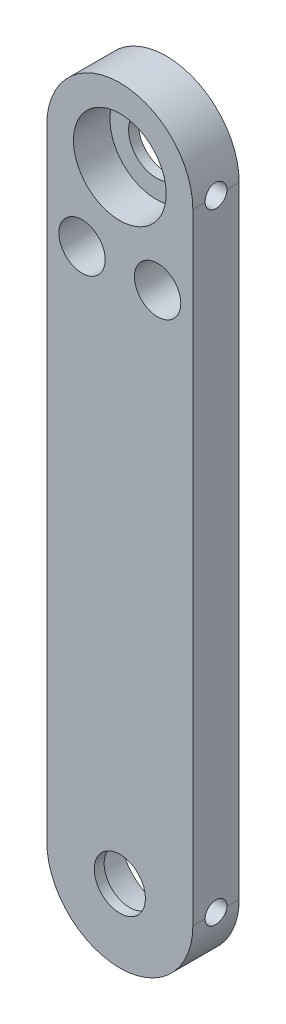
ISO-10303-21;
HEADER;
FILE_DESCRIPTION(('STEP AP214'),'2;1');
FILE_NAME('part.step','',(''),(''),'','','');
FILE_SCHEMA(('AUTOMOTIVE_DESIGN { 1 0 10303 214 1 1 1 1 }'));
ENDSEC;
DATA;
#1=APPLICATION_CONTEXT('core data for automotive mechanical design processes');
#2=APPLICATION_PROTOCOL_DEFINITION('international standard','automotive_design',2000,#1);
#3=PRODUCT_CONTEXT('',#1,'mechanical');
#4=PRODUCT('Part','Part','',(#3));
#5=PRODUCT_RELATED_PRODUCT_CATEGORY('part','',(#4));
#6=PRODUCT_DEFINITION_FORMATION('','',#4);
#7=PRODUCT_DEFINITION_CONTEXT('part definition',#1,'design');
#8=PRODUCT_DEFINITION('design','',#6,#7);
#9=PRODUCT_DEFINITION_SHAPE('','',#8);
#10=(LENGTH_UNIT() NAMED_UNIT(*) SI_UNIT(.MILLI.,.METRE.));
#11=(NAMED_UNIT(*) PLANE_ANGLE_UNIT() SI_UNIT($,.RADIAN.));
#12=(NAMED_UNIT(*) SI_UNIT($,.STERADIAN.) SOLID_ANGLE_UNIT());
#13=UNCERTAINTY_MEASURE_WITH_UNIT(LENGTH_MEASURE(1.E-05),#10,'distance_accuracy_value','');
#14=(GEOMETRIC_REPRESENTATION_CONTEXT(3) GLOBAL_UNCERTAINTY_ASSIGNED_CONTEXT((#13)) GLOBAL_UNIT_ASSIGNED_CONTEXT((#10,
#11,#12)) REPRESENTATION_CONTEXT('',''));
#15=CARTESIAN_POINT('',(0.,0.,0.));
#16=DIRECTION('',(0.,0.,1.));
#17=DIRECTION('',(1.,0.,0.));
#18=AXIS2_PLACEMENT_3D('',#15,#16,#17);
#19=CARTESIAN_POINT('',(0.,42.5,6.35));
#20=DIRECTION('',(0.,0.,-1.));
#21=DIRECTION('',(-1.,0.,0.));
#22=AXIS2_PLACEMENT_3D('',#19,#20,#21);
#23=CYLINDRICAL_SURFACE('',#22,10.);
#24=DIRECTION('',(0.,0.,-1.));
#25=VECTOR('',#24,1.);
#26=CARTESIAN_POINT('',(10.,42.5,6.35));
#27=LINE('',#26,#25);
#28=CARTESIAN_POINT('',(10.,42.5,6.35));
#29=VERTEX_POINT('',#28);
#30=CARTESIAN_POINT('',(10.,42.5,4.675));
#31=VERTEX_POINT('',#30);
#32=EDGE_CURVE('E116',#29,#31,#27,.T.);
#33=ORIENTED_EDGE('',*,*,#32,.T.);
#34=CARTESIAN_POINT('',(10.,42.5,4.675));
#35=CARTESIAN_POINT('',(10.0000014685064,42.5419508736504,4.67499999537497));
#36=CARTESIAN_POINT('',(9.99973568704625,42.5838814247861,4.67323901308362));
#37=CARTESIAN_POINT('',(9.99868521479132,42.6674379610659,4.66621554686748));
#38=CARTESIAN_POINT('',(9.99790056985297,42.709063972796,4.66095337237313));
#39=CARTESIAN_POINT('',(9.99479588619007,42.8329314886251,4.63997389798776));
#40=CARTESIAN_POINT('',(9.99172497314488,42.914336104094,4.61906345213101));
#41=CARTESIAN_POINT('',(9.98391758917327,43.0724284238681,4.56400833880989));
#42=CARTESIAN_POINT('',(9.97918066213689,43.1491148296921,4.52986004691619));
#43=CARTESIAN_POINT('',(9.96856534959666,43.295678956542,4.44931680441856));
#44=CARTESIAN_POINT('',(9.96268699957248,43.3655568890993,4.40292223445846));
#45=CARTESIAN_POINT('',(9.95039202655103,43.4970445259113,4.29882526877398));
#46=CARTESIAN_POINT('',(9.94397197786064,43.5585940245488,4.24104725672947));
#47=CARTESIAN_POINT('',(9.9313432234057,43.6711695622192,4.11597898804128));
#48=CARTESIAN_POINT('',(9.92513455081533,43.7221939557012,4.04868724673824));
#49=CARTESIAN_POINT('',(9.91359860664948,43.8124986952271,3.90609726537435));
#50=CARTESIAN_POINT('',(9.90827581009233,43.8517201783024,3.83076135392111));
#51=CARTESIAN_POINT('',(9.89916189093434,43.9169278188574,3.67448245934921));
#52=CARTESIAN_POINT('',(9.89537059586199,43.9429154667638,3.59354010880837));
#53=CARTESIAN_POINT('',(9.88978259593446,43.980731765885,3.42898294683241));
#54=CARTESIAN_POINT('',(9.88797120063499,43.9926647518175,3.34539262016964));
#55=CARTESIAN_POINT('',(9.88650348181945,44.002356291557,3.17737586593599));
#56=CARTESIAN_POINT('',(9.88684708626085,44.0001153192052,3.09294946640957));
#57=CARTESIAN_POINT('',(9.88963718763456,43.9816073070065,2.92639867029685));
#58=CARTESIAN_POINT('',(9.89206620232456,43.9654568683382,2.84426098127215));
#59=CARTESIAN_POINT('',(9.89872610639239,43.9197709914713,2.68387516321022));
#60=CARTESIAN_POINT('',(9.90295703599484,43.8902352544683,2.60562712104614));
#61=CARTESIAN_POINT('',(9.9127634526375,43.8184953494658,2.45488514064788));
#62=CARTESIAN_POINT('',(9.91834418902924,43.7762415606178,2.38241517319383));
#63=CARTESIAN_POINT('',(9.93021732397089,43.6803019201499,2.2455528505844));
#64=CARTESIAN_POINT('',(9.93650974119488,43.6266157685189,2.18116070747983));
#65=CARTESIAN_POINT('',(9.94917383032146,43.5087036654829,2.06161087632561));
#66=CARTESIAN_POINT('',(9.95554567106682,43.4443788291936,2.00655070165109));
#67=CARTESIAN_POINT('',(9.96759485035053,43.3073265565302,1.90797639950773));
#68=CARTESIAN_POINT('',(9.97327198853175,43.2345967077954,1.86446559874978));
#69=CARTESIAN_POINT('',(9.98329879009977,43.0827046110578,1.79022045732164));
#70=CARTESIAN_POINT('',(9.98764689268088,43.0035349372274,1.75950112360303));
#71=CARTESIAN_POINT('',(9.99450841265943,42.8411362683109,1.7118654141282));
#72=CARTESIAN_POINT('',(9.99702457329285,42.757913542677,1.69492839559142));
#73=CARTESIAN_POINT('',(9.9989901194856,42.6450605368035,1.68174566903024));
#74=CARTESIAN_POINT('',(9.99936853868558,42.6160817227372,1.679214915476));
#75=CARTESIAN_POINT('',(9.99987320258129,42.5580727726573,1.67584431341621));
#76=CARTESIAN_POINT('',(9.99999987181746,42.529042805815,1.67500161822181));
#77=CARTESIAN_POINT('',(10.,42.5,1.675));
#78=B_SPLINE_CURVE_WITH_KNOTS('',3,(#34,#35,#36,#37,#38,#39,#40,#41,#42,#43,#44,#45,#46,#47,#48,
#49,#50,#51,#52,#53,#54,#55,#56,#57,#58,#59,#60,#61,#62,#63,#64,#65,#66,#67,#68,#69,#70,#71,#72,
#73,#74,#75,#76,#77),.UNSPECIFIED.,.F.,.F.,(4,2,2,2,2,2,2,2,2,2,2,2,2,2,2,2,2,2,2,2,2,4),(0.,
0.12577459600247,0.251538077699336,0.502550836025008,0.75363236847621,1.00470609762705,
1.25750755614574,1.5103485090807,1.7644302832657,2.01848343580799,2.27063849496755,
2.52278512452482,2.7728383913245,3.02289724042137,3.27394465404092,3.52499865652247,
3.77853286607112,4.03214002520141,4.28604388366317,4.53956674814969,4.62680426579007,
4.71389454454004),.UNSPECIFIED.);
#79=CARTESIAN_POINT('',(10.,42.5,1.675));
#80=VERTEX_POINT('',#79);
#81=EDGE_CURVE('E65',#31,#80,#78,.T.);
#82=ORIENTED_EDGE('',*,*,#81,.T.);
#83=CARTESIAN_POINT('',(10.,42.5,0.));
#84=VERTEX_POINT('',#83);
#85=EDGE_CURVE('E198',#80,#84,#27,.T.);
#86=ORIENTED_EDGE('',*,*,#85,.T.);
#87=CARTESIAN_POINT('',(0.,42.5,0.));
#88=DIRECTION('',(0.,0.,1.));
#89=DIRECTION('',(1.,0.,0.));
#90=AXIS2_PLACEMENT_3D('',#87,#88,#89);
#91=CIRCLE('',#90,10.);
#92=CARTESIAN_POINT('',(-9.99999999999999,42.5,0.));
#93=VERTEX_POINT('',#92);
#94=EDGE_CURVE('E186',#84,#93,#91,.T.);
#95=ORIENTED_EDGE('',*,*,#94,.T.);
#96=DIRECTION('',(0.,0.,-1.));
#97=VECTOR('',#96,1.);
#98=CARTESIAN_POINT('',(-9.99999999999999,42.5,6.35));
#99=LINE('',#98,#97);
#100=CARTESIAN_POINT('',(-9.99999999999999,42.5,6.35));
#101=VERTEX_POINT('',#100);
#102=EDGE_CURVE('E11',#101,#93,#99,.T.);
#103=ORIENTED_EDGE('',*,*,#102,.F.);
#104=CARTESIAN_POINT('',(0.,42.5,6.35));
#105=DIRECTION('',(0.,0.,1.));
#106=DIRECTION('',(1.,0.,0.));
#107=AXIS2_PLACEMENT_3D('',#104,#105,#106);
#108=CIRCLE('',#107,10.);
#109=EDGE_CURVE('E189',#29,#101,#108,.T.);
#110=ORIENTED_EDGE('',*,*,#109,.F.);
#111=EDGE_LOOP('',(#33,#82,#86,#95,#103,#110));
#112=FACE_BOUND('',#111,.T.);
#113=ADVANCED_FACE('F37',(#112),#23,.T.);
#114=CARTESIAN_POINT('',(-9.99999999999999,42.5,6.35));
#115=DIRECTION('',(1.,0.,0.));
#116=DIRECTION('',(0.,0.,-1.));
#117=AXIS2_PLACEMENT_3D('',#114,#115,#116);
#118=PLANE('',#117);
#119=DIRECTION('',(0.,-1.,0.));
#120=VECTOR('',#119,1.);
#121=CARTESIAN_POINT('',(-9.99999999999999,42.5,0.));
#122=LINE('',#121,#120);
#123=CARTESIAN_POINT('',(-10.,-42.5,0.));
#124=VERTEX_POINT('',#123);
#125=EDGE_CURVE('E201',#93,#124,#122,.T.);
#126=ORIENTED_EDGE('',*,*,#125,.T.);
#127=DIRECTION('',(0.,0.,-1.));
#128=VECTOR('',#127,1.);
#129=CARTESIAN_POINT('',(-10.,-42.5,6.35));
#130=LINE('',#129,#128);
#131=CARTESIAN_POINT('',(-10.,-42.5,6.35));
#132=VERTEX_POINT('',#131);
#133=EDGE_CURVE('E51',#132,#124,#130,.T.);
#134=ORIENTED_EDGE('',*,*,#133,.F.);
#135=DIRECTION('',(0.,-1.,0.));
#136=VECTOR('',#135,1.);
#137=CARTESIAN_POINT('',(-9.99999999999999,42.5,6.35));
#138=LINE('',#137,#136);
#139=EDGE_CURVE('E192',#101,#132,#138,.T.);
#140=ORIENTED_EDGE('',*,*,#139,.F.);
#141=ORIENTED_EDGE('',*,*,#102,.T.);
#142=EDGE_LOOP('',(#126,#134,#140,#141));
#143=FACE_BOUND('',#142,.T.);
#144=ADVANCED_FACE('F248',(#143),#118,.F.);
#145=CARTESIAN_POINT('',(0.,-42.5,6.35));
#146=DIRECTION('',(0.,0.,-1.));
#147=DIRECTION('',(-1.,0.,0.));
#148=AXIS2_PLACEMENT_3D('',#145,#146,#147);
#149=CYLINDRICAL_SURFACE('',#148,10.);
#150=DIRECTION('',(0.,0.,-1.));
#151=VECTOR('',#150,1.);
#152=CARTESIAN_POINT('',(10.,-42.5,6.35));
#153=LINE('',#152,#151);
#154=CARTESIAN_POINT('',(10.,-42.5,1.675));
#155=VERTEX_POINT('',#154);
#156=CARTESIAN_POINT('',(10.,-42.5,0.));
#157=VERTEX_POINT('',#156);
#158=EDGE_CURVE('E107',#155,#157,#153,.T.);
#159=ORIENTED_EDGE('',*,*,#158,.F.);
#160=CARTESIAN_POINT('',(10.,-42.5,1.675));
#161=CARTESIAN_POINT('',(10.0000014685064,-42.5419508736504,1.67500000462503));
#162=CARTESIAN_POINT('',(9.99973568704625,-42.5838814247861,1.67676098691638));
#163=CARTESIAN_POINT('',(9.99868521479133,-42.6674379610659,1.68378445313252));
#164=CARTESIAN_POINT('',(9.99790056985298,-42.709063972796,1.68904662762687));
#165=CARTESIAN_POINT('',(9.99479588619008,-42.8329314886251,1.71002610201224));
#166=CARTESIAN_POINT('',(9.99172497314488,-42.914336104094,1.73093654786898));
#167=CARTESIAN_POINT('',(9.98391758917327,-43.0724284238681,1.78599166119011));
#168=CARTESIAN_POINT('',(9.97918066213689,-43.1491148296921,1.82013995308381));
#169=CARTESIAN_POINT('',(9.96856534959666,-43.295678956542,1.90068319558144));
#170=CARTESIAN_POINT('',(9.96268699957249,-43.3655568890993,1.94707776554154));
#171=CARTESIAN_POINT('',(9.95039202655103,-43.4970445259113,2.05117473122602));
#172=CARTESIAN_POINT('',(9.94397197786064,-43.5585940245488,2.10895274327053));
#173=CARTESIAN_POINT('',(9.93134322340571,-43.6711695622192,2.23402101195872));
#174=CARTESIAN_POINT('',(9.92513455081533,-43.7221939557012,2.30131275326176));
#175=CARTESIAN_POINT('',(9.91359860664949,-43.8124986952271,2.44390273462565));
#176=CARTESIAN_POINT('',(9.90827581009234,-43.8517201783024,2.51923864607889));
#177=CARTESIAN_POINT('',(9.89916189093434,-43.9169278188574,2.67551754065079));
#178=CARTESIAN_POINT('',(9.895370595862,-43.9429154667638,2.75645989119162));
#179=CARTESIAN_POINT('',(9.88978259593446,-43.980731765885,2.92101705316758));
#180=CARTESIAN_POINT('',(9.887971200635,-43.9926647518175,3.00460737983036));
#181=CARTESIAN_POINT('',(9.88650348181946,-44.002356291557,3.17262413406401));
#182=CARTESIAN_POINT('',(9.88684708626086,-44.0001153192052,3.25705053359043));
#183=CARTESIAN_POINT('',(9.88963718763457,-43.9816073070065,3.42360132970315));
#184=CARTESIAN_POINT('',(9.89206620232456,-43.9654568683382,3.50573901872784));
#185=CARTESIAN_POINT('',(9.89872610639239,-43.9197709914713,3.66612483678978));
#186=CARTESIAN_POINT('',(9.90295703599485,-43.8902352544683,3.74437287895386));
#187=CARTESIAN_POINT('',(9.9127634526375,-43.8184953494658,3.89511485935212));
#188=CARTESIAN_POINT('',(9.91834418902924,-43.7762415606178,3.96758482680617));
#189=CARTESIAN_POINT('',(9.9302173239709,-43.6803019201499,4.1044471494156));
#190=CARTESIAN_POINT('',(9.93650974119489,-43.6266157685189,4.16883929252017));
#191=CARTESIAN_POINT('',(9.94917383032147,-43.5087036654829,4.28838912367439));
#192=CARTESIAN_POINT('',(9.95554567106682,-43.4443788291936,4.3434492983489));
#193=CARTESIAN_POINT('',(9.96759485035054,-43.3073265565302,4.44202360049227));
#194=CARTESIAN_POINT('',(9.97327198853176,-43.2345967077954,4.48553440125022));
#195=CARTESIAN_POINT('',(9.98329879009978,-43.0827046110578,4.55977954267836));
#196=CARTESIAN_POINT('',(9.98764689268089,-43.0035349372274,4.59049887639697));
#197=CARTESIAN_POINT('',(9.99450841265944,-42.8411362683109,4.6381345858718));
#198=CARTESIAN_POINT('',(9.99702457329285,-42.757913542677,4.65507160440857));
#199=CARTESIAN_POINT('',(9.99899011948561,-42.6450605368035,4.66825433096976));
#200=CARTESIAN_POINT('',(9.99936853868559,-42.6160817227372,4.670785084524));
#201=CARTESIAN_POINT('',(9.99987320258129,-42.5580727726573,4.67415568658379));
#202=CARTESIAN_POINT('',(9.99999987181746,-42.529042805815,4.67499838177819));
#203=CARTESIAN_POINT('',(10.,-42.5,4.675));
#204=B_SPLINE_CURVE_WITH_KNOTS('',3,(#160,#161,#162,#163,#164,#165,#166,#167,#168,#169,#170,
#171,#172,#173,#174,#175,#176,#177,#178,#179,#180,#181,#182,#183,#184,#185,#186,#187,#188,#189,
#190,#191,#192,#193,#194,#195,#196,#197,#198,#199,#200,#201,#202,#203),.UNSPECIFIED.,.F.,.F.,(4,
2,2,2,2,2,2,2,2,2,2,2,2,2,2,2,2,2,2,2,2,4),(0.,0.12577459600247,0.251538077699336,
0.502550836025008,0.75363236847621,1.00470609762705,1.25750755614574,1.5103485090807,
1.7644302832657,2.01848343580799,2.27063849496754,2.52278512452482,2.7728383913245,
3.02289724042137,3.27394465404091,3.52499865652247,3.77853286607112,4.03214002520141,
4.28604388366317,4.53956674814969,4.62680426579006,4.71389454454004),.UNSPECIFIED.);
#205=CARTESIAN_POINT('',(10.,-42.5,4.675));
#206=VERTEX_POINT('',#205);
#207=EDGE_CURVE('E58',#155,#206,#204,.T.);
#208=ORIENTED_EDGE('',*,*,#207,.T.);
#209=CARTESIAN_POINT('',(10.,-42.5,6.35));
#210=VERTEX_POINT('',#209);
#211=EDGE_CURVE('E104',#210,#206,#153,.T.);
#212=ORIENTED_EDGE('',*,*,#211,.F.);
#213=CARTESIAN_POINT('',(0.,-42.5,6.35));
#214=DIRECTION('',(0.,0.,1.));
#215=DIRECTION('',(1.,0.,0.));
#216=AXIS2_PLACEMENT_3D('',#213,#214,#215);
#217=CIRCLE('',#216,10.);
#218=EDGE_CURVE('E195',#132,#210,#217,.T.);
#219=ORIENTED_EDGE('',*,*,#218,.F.);
#220=ORIENTED_EDGE('',*,*,#133,.T.);
#221=CARTESIAN_POINT('',(0.,-42.5,0.));
#222=DIRECTION('',(0.,0.,1.));
#223=DIRECTION('',(1.,0.,0.));
#224=AXIS2_PLACEMENT_3D('',#221,#222,#223);
#225=CIRCLE('',#224,10.);
#226=EDGE_CURVE('E203',#124,#157,#225,.T.);
#227=ORIENTED_EDGE('',*,*,#226,.T.);
#228=EDGE_LOOP('',(#159,#208,#212,#219,#220,#227));
#229=FACE_BOUND('',#228,.T.);
#230=ADVANCED_FACE('F102',(#229),#149,.T.);
#231=CARTESIAN_POINT('',(10.,42.5,6.35));
#232=DIRECTION('',(-1.,0.,0.));
#233=DIRECTION('',(0.,0.,1.));
#234=AXIS2_PLACEMENT_3D('',#231,#232,#233);
#235=PLANE('',#234);
#236=ORIENTED_EDGE('',*,*,#211,.T.);
#237=CARTESIAN_POINT('',(10.,-42.5,3.175));
#238=DIRECTION('',(1.,0.,0.));
#239=DIRECTION('',(0.,0.,-1.));
#240=AXIS2_PLACEMENT_3D('',#237,#238,#239);
#241=CIRCLE('',#240,1.5);
#242=EDGE_CURVE('E94',#155,#206,#241,.T.);
#243=ORIENTED_EDGE('',*,*,#242,.F.);
#244=ORIENTED_EDGE('',*,*,#158,.T.);
#245=DIRECTION('',(0.,1.,0.));
#246=VECTOR('',#245,1.);
#247=CARTESIAN_POINT('',(10.,42.5,0.));
#248=LINE('',#247,#246);
#249=EDGE_CURVE('E193',#157,#84,#248,.T.);
#250=ORIENTED_EDGE('',*,*,#249,.T.);
#251=ORIENTED_EDGE('',*,*,#85,.F.);
#252=CARTESIAN_POINT('',(10.,42.5,3.175));
#253=DIRECTION('',(1.,0.,0.));
#254=DIRECTION('',(0.,0.,-1.));
#255=AXIS2_PLACEMENT_3D('',#252,#253,#254);
#256=CIRCLE('',#255,1.5);
#257=EDGE_CURVE('E135',#31,#80,#256,.T.);
#258=ORIENTED_EDGE('',*,*,#257,.F.);
#259=ORIENTED_EDGE('',*,*,#32,.F.);
#260=DIRECTION('',(0.,1.,0.));
#261=VECTOR('',#260,1.);
#262=CARTESIAN_POINT('',(10.,42.5,6.35));
#263=LINE('',#262,#261);
#264=EDGE_CURVE('E112',#210,#29,#263,.T.);
#265=ORIENTED_EDGE('',*,*,#264,.F.);
#266=EDGE_LOOP('',(#236,#243,#244,#250,#251,#258,#259,#265));
#267=FACE_BOUND('',#266,.T.);
#268=ADVANCED_FACE('F110',(#267),#235,.F.);
#269=CARTESIAN_POINT('',(0.,42.5,6.35));
#270=DIRECTION('',(0.,0.,1.));
#271=DIRECTION('',(1.,0.,0.));
#272=AXIS2_PLACEMENT_3D('',#269,#270,#271);
#273=PLANE('',#272);
#274=CARTESIAN_POINT('',(0.,-42.5,6.35));
#275=DIRECTION('',(0.,0.,1.));
#276=DIRECTION('',(1.,0.,0.));
#277=AXIS2_PLACEMENT_3D('',#274,#275,#276);
#278=CIRCLE('',#277,3.5);
#279=CARTESIAN_POINT('',(3.5,-42.5,6.35));
#280=VERTEX_POINT('',#279);
#281=EDGE_CURVE('E136',#280,#280,#278,.T.);
#282=ORIENTED_EDGE('',*,*,#281,.F.);
#283=EDGE_LOOP('',(#282));
#284=FACE_BOUND('',#283,.T.);
#285=CARTESIAN_POINT('',(5.175,30.5,6.35));
#286=DIRECTION('',(0.,0.,1.));
#287=DIRECTION('',(1.,0.,0.));
#288=AXIS2_PLACEMENT_3D('',#285,#286,#287);
#289=CIRCLE('',#288,3.175);
#290=CARTESIAN_POINT('',(8.35,30.5,6.35));
#291=VERTEX_POINT('',#290);
#292=EDGE_CURVE('E169',#291,#291,#289,.T.);
#293=ORIENTED_EDGE('',*,*,#292,.F.);
#294=EDGE_LOOP('',(#293));
#295=FACE_BOUND('',#294,.T.);
#296=CARTESIAN_POINT('',(-5.175,30.5,6.35));
#297=DIRECTION('',(0.,0.,1.));
#298=DIRECTION('',(-1.,0.,0.));
#299=AXIS2_PLACEMENT_3D('',#296,#297,#298);
#300=CIRCLE('',#299,3.175);
#301=CARTESIAN_POINT('',(-8.35,30.5,6.35));
#302=VERTEX_POINT('',#301);
#303=EDGE_CURVE('E127',#302,#302,#300,.T.);
#304=ORIENTED_EDGE('',*,*,#303,.F.);
#305=EDGE_LOOP('',(#304));
#306=FACE_BOUND('',#305,.T.);
#307=CARTESIAN_POINT('',(0.,42.5,6.35));
#308=DIRECTION('',(0.,0.,1.));
#309=DIRECTION('',(1.,0.,0.));
#310=AXIS2_PLACEMENT_3D('',#307,#308,#309);
#311=CIRCLE('',#310,6.35);
#312=CARTESIAN_POINT('',(6.35,42.5,6.35));
#313=VERTEX_POINT('',#312);
#314=EDGE_CURVE('E180',#313,#313,#311,.T.);
#315=ORIENTED_EDGE('',*,*,#314,.F.);
#316=EDGE_LOOP('',(#315));
#317=FACE_BOUND('',#316,.T.);
#318=ORIENTED_EDGE('',*,*,#109,.T.);
#319=ORIENTED_EDGE('',*,*,#139,.T.);
#320=ORIENTED_EDGE('',*,*,#218,.T.);
#321=ORIENTED_EDGE('',*,*,#264,.T.);
#322=EDGE_LOOP('',(#318,#319,#320,#321));
#323=FACE_BOUND('',#322,.T.);
#324=ADVANCED_FACE('F258',(#284,#295,#306,#317,#323),#273,.T.);
#325=CARTESIAN_POINT('',(0.,42.5,0.));
#326=DIRECTION('',(0.,0.,1.));
#327=DIRECTION('',(1.,0.,0.));
#328=AXIS2_PLACEMENT_3D('',#325,#326,#327);
#329=PLANE('',#328);
#330=CARTESIAN_POINT('',(0.,-42.5,0.));
#331=DIRECTION('',(0.,0.,-1.));
#332=DIRECTION('',(-1.,0.,0.));
#333=AXIS2_PLACEMENT_3D('',#330,#331,#332);
#334=CIRCLE('',#333,6.35);
#335=CARTESIAN_POINT('',(-6.35,-42.5,0.));
#336=VERTEX_POINT('',#335);
#337=EDGE_CURVE('E217',#336,#336,#334,.T.);
#338=ORIENTED_EDGE('',*,*,#337,.F.);
#339=EDGE_LOOP('',(#338));
#340=FACE_BOUND('',#339,.T.);
#341=CARTESIAN_POINT('',(-5.175,30.5,0.));
#342=DIRECTION('',(0.,0.,1.));
#343=DIRECTION('',(1.,0.,0.));
#344=AXIS2_PLACEMENT_3D('',#341,#342,#343);
#345=CIRCLE('',#344,1.5);
#346=CARTESIAN_POINT('',(-3.675,30.5,0.));
#347=VERTEX_POINT('',#346);
#348=EDGE_CURVE('E123',#347,#347,#345,.T.);
#349=ORIENTED_EDGE('',*,*,#348,.T.);
#350=EDGE_LOOP('',(#349));
#351=FACE_BOUND('',#350,.T.);
#352=CARTESIAN_POINT('',(5.175,30.5,0.));
#353=DIRECTION('',(0.,0.,1.));
#354=DIRECTION('',(1.,0.,0.));
#355=AXIS2_PLACEMENT_3D('',#352,#353,#354);
#356=CIRCLE('',#355,1.5);
#357=CARTESIAN_POINT('',(6.675,30.5,0.));
#358=VERTEX_POINT('',#357);
#359=EDGE_CURVE('E120',#358,#358,#356,.T.);
#360=ORIENTED_EDGE('',*,*,#359,.T.);
#361=EDGE_LOOP('',(#360));
#362=FACE_BOUND('',#361,.T.);
#363=CARTESIAN_POINT('',(0.,42.5,0.));
#364=DIRECTION('',(0.,0.,1.));
#365=DIRECTION('',(1.,0.,0.));
#366=AXIS2_PLACEMENT_3D('',#363,#364,#365);
#367=CIRCLE('',#366,3.8);
#368=CARTESIAN_POINT('',(3.8,42.5,0.));
#369=VERTEX_POINT('',#368);
#370=EDGE_CURVE('E177',#369,#369,#367,.T.);
#371=ORIENTED_EDGE('',*,*,#370,.T.);
#372=EDGE_LOOP('',(#371));
#373=FACE_BOUND('',#372,.T.);
#374=ORIENTED_EDGE('',*,*,#94,.F.);
#375=ORIENTED_EDGE('',*,*,#249,.F.);
#376=ORIENTED_EDGE('',*,*,#226,.F.);
#377=ORIENTED_EDGE('',*,*,#125,.F.);
#378=EDGE_LOOP('',(#374,#375,#376,#377));
#379=FACE_BOUND('',#378,.T.);
#380=ADVANCED_FACE('F210',(#340,#351,#362,#373,#379),#329,.F.);
#381=CARTESIAN_POINT('',(0.,42.5,1.35));
#382=DIRECTION('',(0.,0.,1.));
#383=DIRECTION('',(1.,0.,0.));
#384=AXIS2_PLACEMENT_3D('',#381,#382,#383);
#385=CYLINDRICAL_SURFACE('',#384,6.35);
#386=CARTESIAN_POINT('',(6.35,42.5,1.675));
#387=CARTESIAN_POINT('',(6.34999851724394,42.5830209487421,1.67500257688155));
#388=CARTESIAN_POINT('',(6.34835548464635,42.6660717055425,1.68191570943469));
#389=CARTESIAN_POINT('',(6.34196006203194,42.8298026167738,1.70934998922864));
#390=CARTESIAN_POINT('',(6.33720570059271,42.9104812342622,1.72987976445553));
#391=CARTESIAN_POINT('',(6.32511541536285,43.067078972002,1.78385930734222));
#392=CARTESIAN_POINT('',(6.31778241043488,43.1430033597441,1.8172944710726));
#393=CARTESIAN_POINT('',(6.3013205537597,43.2881641285173,1.89608655368896));
#394=CARTESIAN_POINT('',(6.29219168938456,43.3574004625148,1.94144355640646));
#395=CARTESIAN_POINT('',(6.27294410619427,43.4885041460754,2.04368053942395));
#396=CARTESIAN_POINT('',(6.26281145281054,43.5502298306782,2.10073957298259));
#397=CARTESIAN_POINT('',(6.24279339171245,43.6633300796207,2.22437709118983));
#398=CARTESIAN_POINT('',(6.23290800919792,43.7147035926849,2.2909565414756));
#399=CARTESIAN_POINT('',(6.21436474587977,43.8062885785891,2.43282095444811));
#400=CARTESIAN_POINT('',(6.20572463411778,43.8463450769596,2.50820849776783));
#401=CARTESIAN_POINT('',(6.19085199880808,43.9131635374986,2.6648836012136));
#402=CARTESIAN_POINT('',(6.18461913528441,43.9399273771435,2.74617032626984));
#403=CARTESIAN_POINT('',(6.1754093638889,43.9789243640839,2.91078791256923));
#404=CARTESIAN_POINT('',(6.17237584620283,43.9914104910839,2.99405560628802));
#405=CARTESIAN_POINT('',(6.16973853210433,44.0022850018873,3.16155484676636));
#406=CARTESIAN_POINT('',(6.17013424074104,44.0006754201675,3.24578625267775));
#407=CARTESIAN_POINT('',(6.17425961423211,43.9836068356708,3.41090996101587));
#408=CARTESIAN_POINT('',(6.17791755158493,43.9684457767716,3.49183512949749));
#409=CARTESIAN_POINT('',(6.18804133190496,43.9251784049009,3.64995972740285));
#410=CARTESIAN_POINT('',(6.19450735566558,43.8970712584127,3.72715891658072));
#411=CARTESIAN_POINT('',(6.20958678218059,43.8284467845848,3.87645664379614));
#412=CARTESIAN_POINT('',(6.218219265795,43.7878184115154,3.94850213199462));
#413=CARTESIAN_POINT('',(6.23664776102025,43.6953826164008,4.08486136281563));
#414=CARTESIAN_POINT('',(6.24644395581355,43.6435734333074,4.14917388495947));
#415=CARTESIAN_POINT('',(6.26640074159939,43.5286879051709,4.26995273495692));
#416=CARTESIAN_POINT('',(6.27656427474605,43.4653592290764,4.32617883022869));
#417=CARTESIAN_POINT('',(6.29588562944103,43.3300525364603,4.42725550259073));
#418=CARTESIAN_POINT('',(6.30504342639666,43.2580743085263,4.47210580155035));
#419=CARTESIAN_POINT('',(6.32135942493142,43.1071916141095,4.54923262841604));
#420=CARTESIAN_POINT('',(6.32851195395597,43.0282683124554,4.58147358631544));
#421=CARTESIAN_POINT('',(6.33996993682454,42.8659165605986,4.63216630266991));
#422=CARTESIAN_POINT('',(6.3442758753518,42.7824888799654,4.65062040865422));
#423=CARTESIAN_POINT('',(6.34948503249582,42.6155535389804,4.67285668601183));
#424=CARTESIAN_POINT('',(6.35046421324578,42.5320918238016,4.6769664522477));
#425=CARTESIAN_POINT('',(6.3491242902122,42.3656739204676,4.67129106790022));
#426=CARTESIAN_POINT('',(6.34680544961474,42.2827176925044,4.66150702605959));
#427=CARTESIAN_POINT('',(6.33917838174839,42.1207798301404,4.62859261840112));
#428=CARTESIAN_POINT('',(6.33390950352625,42.0417604890031,4.60563783257741));
#429=CARTESIAN_POINT('',(6.3209740002995,41.8886959136126,4.54723149966577));
#430=CARTESIAN_POINT('',(6.31330714919518,41.8146511492018,4.51177877413379));
#431=CARTESIAN_POINT('',(6.29624149651372,41.672310695681,4.4287264483997));
#432=CARTESIAN_POINT('',(6.28681663475877,41.604127654475,4.38093926429423));
#433=CARTESIAN_POINT('',(6.2673266811016,41.4766314517236,4.27481752950993));
#434=CARTESIAN_POINT('',(6.25726149136241,41.4173196502941,4.21648136451076));
#435=CARTESIAN_POINT('',(6.23735679650375,41.3079241957992,4.08940401687873));
#436=CARTESIAN_POINT('',(6.22752694929492,41.2580690961075,4.02046426640514));
#437=CARTESIAN_POINT('',(6.20945265145426,41.1706397078834,3.87500057804812));
#438=CARTESIAN_POINT('',(6.2012081299286,41.1330648701401,3.7984769795371));
#439=CARTESIAN_POINT('',(6.1873240848113,41.0715336346671,3.64043566793411));
#440=CARTESIAN_POINT('',(6.18166930794986,41.047497298881,3.5589504859383));
#441=CARTESIAN_POINT('',(6.17358371023306,41.0135023808069,3.39294412141734));
#442=CARTESIAN_POINT('',(6.17115227288946,41.0035411065321,3.30842352261579));
#443=CARTESIAN_POINT('',(6.16983199335337,40.9981081090918,3.14106112146151));
#444=CARTESIAN_POINT('',(6.1708541839276,41.0022725122384,3.05823163293272));
#445=CARTESIAN_POINT('',(6.17612233302334,41.0241486824006,2.89449127444565));
#446=CARTESIAN_POINT('',(6.18036823966433,41.0418602313968,2.81358037363241));
#447=CARTESIAN_POINT('',(6.19155859321836,41.0901393302196,2.65632098353121));
#448=CARTESIAN_POINT('',(6.19849016148399,41.120645581895,2.57995269713613));
#449=CARTESIAN_POINT('',(6.21427398682872,41.1935982482732,2.43336716284176));
#450=CARTESIAN_POINT('',(6.2231264810561,41.2360461374252,2.36315067591788));
#451=CARTESIAN_POINT('',(6.24201391004487,41.3328479374515,2.22908721321493));
#452=CARTESIAN_POINT('',(6.25207168946106,41.3874575011935,2.1654280187217));
#453=CARTESIAN_POINT('',(6.27209257501467,41.5065250551108,2.0480583428238));
#454=CARTESIAN_POINT('',(6.2820556584478,41.5709853468298,1.99435019290582));
#455=CARTESIAN_POINT('',(6.30095070373692,41.7091449224679,1.8975916638141));
#456=CARTESIAN_POINT('',(6.30986403352164,41.7829733035021,1.85472173683658));
#457=CARTESIAN_POINT('',(6.32546353967865,41.936988746183,1.78206930320467));
#458=CARTESIAN_POINT('',(6.33215143699731,42.0171708347603,1.752276678042));
#459=CARTESIAN_POINT('',(6.34146337323501,42.1644312976428,1.71145636515545));
#460=CARTESIAN_POINT('',(6.34464362420469,42.2307618976541,1.69781315294047));
#461=CARTESIAN_POINT('',(6.34891247920239,42.3647217864704,1.67958419109222));
#462=CARTESIAN_POINT('',(6.35000120821274,42.4323509974308,1.67499790024723));
#463=CARTESIAN_POINT('',(6.35,42.5,1.675));
#464=B_SPLINE_CURVE_WITH_KNOTS('',3,(#386,#387,#388,#389,#390,#391,#392,#393,#394,#395,#396,
#397,#398,#399,#400,#401,#402,#403,#404,#405,#406,#407,#408,#409,#410,#411,#412,#413,#414,#415,
#416,#417,#418,#419,#420,#421,#422,#423,#424,#425,#426,#427,#428,#429,#430,#431,#432,#433,#434,
#435,#436,#437,#438,#439,#440,#441,#442,#443,#444,#445,#446,#447,#448,#449,#450,#451,#452,#453,
#454,#455,#456,#457,#458,#459,#460,#461,#462,#463),.UNSPECIFIED.,.T.,.F.,(4,2,2,2,2,2,2,2,2,2,2,
2,2,2,2,2,2,2,2,2,2,2,2,2,2,2,2,2,2,2,2,2,2,2,2,2,2,2,4),(0.,0.248815070913742,
0.497787950658723,0.746479911109816,0.995173620349725,1.24800235932538,1.50085676043726,
1.75702225097101,2.01315154998107,2.26466865776917,2.51614946391932,2.76223359968085,
3.00833358145962,3.25668218758358,3.50506993876883,3.75975438391661,4.01444505532947,
4.26984909538289,4.52520963709547,4.77469868586512,5.02416782622496,5.27038608564858,
5.51662756746636,5.76686059612936,6.01713195064178,6.2728421065447,6.52854082474265,
6.78271350366646,7.0368375631117,7.28446569177386,7.53208983534431,7.7785409483085,
8.02502250427131,8.2772790529975,8.5295946298092,8.78586924469398,9.04194521710613,
9.24470244341197,9.44744755324905),.UNSPECIFIED.);
#465=CARTESIAN_POINT('',(6.35,42.5,1.675));
#466=VERTEX_POINT('',#465);
#467=EDGE_CURVE('E128',#466,#466,#464,.T.);
#468=ORIENTED_EDGE('',*,*,#467,.T.);
#469=EDGE_LOOP('',(#468));
#470=FACE_BOUND('',#469,.T.);
#471=CARTESIAN_POINT('',(0.,42.5,1.35));
#472=DIRECTION('',(0.,0.,1.));
#473=DIRECTION('',(1.,0.,0.));
#474=AXIS2_PLACEMENT_3D('',#471,#472,#473);
#475=CIRCLE('',#474,6.35);
#476=CARTESIAN_POINT('',(6.35,42.5,1.35));
#477=VERTEX_POINT('',#476);
#478=EDGE_CURVE('E183',#477,#477,#475,.T.);
#479=ORIENTED_EDGE('',*,*,#478,.F.);
#480=EDGE_LOOP('',(#479));
#481=FACE_BOUND('',#480,.T.);
#482=ORIENTED_EDGE('',*,*,#314,.T.);
#483=EDGE_LOOP('',(#482));
#484=FACE_BOUND('',#483,.T.);
#485=ADVANCED_FACE('F137',(#470,#481,#484),#385,.F.);
#486=CARTESIAN_POINT('',(0.,42.5,1.35));
#487=DIRECTION('',(0.,0.,1.));
#488=DIRECTION('',(1.,0.,0.));
#489=AXIS2_PLACEMENT_3D('',#486,#487,#488);
#490=PLANE('',#489);
#491=CARTESIAN_POINT('',(0.,42.5,1.35));
#492=DIRECTION('',(0.,0.,1.));
#493=DIRECTION('',(1.,0.,0.));
#494=AXIS2_PLACEMENT_3D('',#491,#492,#493);
#495=CIRCLE('',#494,3.8);
#496=CARTESIAN_POINT('',(3.8,42.5,1.35));
#497=VERTEX_POINT('',#496);
#498=EDGE_CURVE('E168',#497,#497,#495,.T.);
#499=ORIENTED_EDGE('',*,*,#498,.F.);
#500=EDGE_LOOP('',(#499));
#501=FACE_BOUND('',#500,.T.);
#502=ORIENTED_EDGE('',*,*,#478,.T.);
#503=EDGE_LOOP('',(#502));
#504=FACE_BOUND('',#503,.T.);
#505=ADVANCED_FACE('F277',(#501,#504),#490,.T.);
#506=CARTESIAN_POINT('',(0.,42.5,0.));
#507=DIRECTION('',(0.,0.,1.));
#508=DIRECTION('',(1.,0.,0.));
#509=AXIS2_PLACEMENT_3D('',#506,#507,#508);
#510=CYLINDRICAL_SURFACE('',#509,3.8);
#511=ORIENTED_EDGE('',*,*,#370,.F.);
#512=EDGE_LOOP('',(#511));
#513=FACE_BOUND('',#512,.T.);
#514=ORIENTED_EDGE('',*,*,#498,.T.);
#515=EDGE_LOOP('',(#514));
#516=FACE_BOUND('',#515,.T.);
#517=ADVANCED_FACE('F282',(#513,#516),#510,.F.);
#518=CARTESIAN_POINT('',(-5.175,30.5,1.35));
#519=DIRECTION('',(0.,0.,1.));
#520=DIRECTION('',(1.,0.,0.));
#521=AXIS2_PLACEMENT_3D('',#518,#519,#520);
#522=CYLINDRICAL_SURFACE('',#521,3.175);
#523=CARTESIAN_POINT('',(-5.175,30.5,1.35));
#524=DIRECTION('',(0.,0.,1.));
#525=DIRECTION('',(-1.,0.,0.));
#526=AXIS2_PLACEMENT_3D('',#523,#524,#525);
#527=CIRCLE('',#526,3.175);
#528=CARTESIAN_POINT('',(-8.35,30.5,1.35));
#529=VERTEX_POINT('',#528);
#530=EDGE_CURVE('E172',#529,#529,#527,.T.);
#531=ORIENTED_EDGE('',*,*,#530,.F.);
#532=EDGE_LOOP('',(#531));
#533=FACE_BOUND('',#532,.T.);
#534=ORIENTED_EDGE('',*,*,#303,.T.);
#535=EDGE_LOOP('',(#534));
#536=FACE_BOUND('',#535,.T.);
#537=ADVANCED_FACE('F291',(#533,#536),#522,.F.);
#538=CARTESIAN_POINT('',(-5.175,30.5,1.35));
#539=DIRECTION('',(0.,0.,-1.));
#540=DIRECTION('',(-1.,0.,0.));
#541=AXIS2_PLACEMENT_3D('',#538,#539,#540);
#542=PLANE('',#541);
#543=CARTESIAN_POINT('',(-5.175,30.5,1.35));
#544=DIRECTION('',(0.,0.,1.));
#545=DIRECTION('',(1.,0.,0.));
#546=AXIS2_PLACEMENT_3D('',#543,#544,#545);
#547=CIRCLE('',#546,1.5);
#548=CARTESIAN_POINT('',(-3.675,30.5,1.35));
#549=VERTEX_POINT('',#548);
#550=EDGE_CURVE('E124',#549,#549,#547,.T.);
#551=ORIENTED_EDGE('',*,*,#550,.F.);
#552=EDGE_LOOP('',(#551));
#553=FACE_BOUND('',#552,.T.);
#554=ORIENTED_EDGE('',*,*,#530,.T.);
#555=EDGE_LOOP('',(#554));
#556=FACE_BOUND('',#555,.T.);
#557=ADVANCED_FACE('F298',(#553,#556),#542,.F.);
#558=CARTESIAN_POINT('',(5.175,30.5,1.35));
#559=DIRECTION('',(0.,0.,1.));
#560=DIRECTION('',(1.,0.,0.));
#561=AXIS2_PLACEMENT_3D('',#558,#559,#560);
#562=CYLINDRICAL_SURFACE('',#561,3.175);
#563=CARTESIAN_POINT('',(5.175,30.5,1.35));
#564=DIRECTION('',(0.,0.,1.));
#565=DIRECTION('',(1.,0.,0.));
#566=AXIS2_PLACEMENT_3D('',#563,#564,#565);
#567=CIRCLE('',#566,3.175);
#568=CARTESIAN_POINT('',(8.35,30.5,1.35));
#569=VERTEX_POINT('',#568);
#570=EDGE_CURVE('E165',#569,#569,#567,.T.);
#571=ORIENTED_EDGE('',*,*,#570,.F.);
#572=EDGE_LOOP('',(#571));
#573=FACE_BOUND('',#572,.T.);
#574=ORIENTED_EDGE('',*,*,#292,.T.);
#575=EDGE_LOOP('',(#574));
#576=FACE_BOUND('',#575,.T.);
#577=ADVANCED_FACE('F302',(#573,#576),#562,.F.);
#578=CARTESIAN_POINT('',(5.175,30.5,1.35));
#579=DIRECTION('',(0.,0.,1.));
#580=DIRECTION('',(1.,0.,0.));
#581=AXIS2_PLACEMENT_3D('',#578,#579,#580);
#582=PLANE('',#581);
#583=CARTESIAN_POINT('',(5.175,30.5,1.35));
#584=DIRECTION('',(0.,0.,1.));
#585=DIRECTION('',(1.,0.,0.));
#586=AXIS2_PLACEMENT_3D('',#583,#584,#585);
#587=CIRCLE('',#586,1.5);
#588=CARTESIAN_POINT('',(6.675,30.5,1.35));
#589=VERTEX_POINT('',#588);
#590=EDGE_CURVE('E159',#589,#589,#587,.T.);
#591=ORIENTED_EDGE('',*,*,#590,.F.);
#592=EDGE_LOOP('',(#591));
#593=FACE_BOUND('',#592,.T.);
#594=ORIENTED_EDGE('',*,*,#570,.T.);
#595=EDGE_LOOP('',(#594));
#596=FACE_BOUND('',#595,.T.);
#597=ADVANCED_FACE('F306',(#593,#596),#582,.T.);
#598=CARTESIAN_POINT('',(5.175,30.5,-3.65));
#599=DIRECTION('',(0.,0.,1.));
#600=DIRECTION('',(1.,0.,0.));
#601=AXIS2_PLACEMENT_3D('',#598,#599,#600);
#602=CYLINDRICAL_SURFACE('',#601,1.5);
#603=ORIENTED_EDGE('',*,*,#590,.T.);
#604=EDGE_LOOP('',(#603));
#605=FACE_BOUND('',#604,.T.);
#606=ORIENTED_EDGE('',*,*,#359,.F.);
#607=EDGE_LOOP('',(#606));
#608=FACE_BOUND('',#607,.T.);
#609=ADVANCED_FACE('F309',(#605,#608),#602,.F.);
#610=CARTESIAN_POINT('',(-5.175,30.5,-3.65));
#611=DIRECTION('',(0.,0.,1.));
#612=DIRECTION('',(1.,0.,0.));
#613=AXIS2_PLACEMENT_3D('',#610,#611,#612);
#614=CYLINDRICAL_SURFACE('',#613,1.5);
#615=ORIENTED_EDGE('',*,*,#550,.T.);
#616=EDGE_LOOP('',(#615));
#617=FACE_BOUND('',#616,.T.);
#618=ORIENTED_EDGE('',*,*,#348,.F.);
#619=EDGE_LOOP('',(#618));
#620=FACE_BOUND('',#619,.T.);
#621=ADVANCED_FACE('F146',(#617,#620),#614,.F.);
#622=CARTESIAN_POINT('',(5.00000000000002,42.5,3.175));
#623=DIRECTION('',(1.,0.,0.));
#624=DIRECTION('',(0.,0.,-1.));
#625=AXIS2_PLACEMENT_3D('',#622,#623,#624);
#626=CYLINDRICAL_SURFACE('',#625,1.5);
#627=ORIENTED_EDGE('',*,*,#467,.F.);
#628=EDGE_LOOP('',(#627));
#629=FACE_BOUND('',#628,.T.);
#630=ORIENTED_EDGE('',*,*,#257,.T.);
#631=ORIENTED_EDGE('',*,*,#81,.F.);
#632=EDGE_LOOP('',(#630,#631));
#633=FACE_BOUND('',#632,.T.);
#634=ADVANCED_FACE('F141',(#629,#633),#626,.F.);
#635=CARTESIAN_POINT('',(0.,-42.5,5.));
#636=DIRECTION('',(0.,0.,-1.));
#637=DIRECTION('',(-1.,0.,0.));
#638=AXIS2_PLACEMENT_3D('',#635,#636,#637);
#639=CYLINDRICAL_SURFACE('',#638,6.35);
#640=CARTESIAN_POINT('',(6.35,-42.5,1.675));
#641=CARTESIAN_POINT('',(6.34999851724395,-42.4169790512579,1.67500257688155));
#642=CARTESIAN_POINT('',(6.34835548464635,-42.3339282944575,1.68191570943469));
#643=CARTESIAN_POINT('',(6.34196006203195,-42.1701973832262,1.70934998922864));
#644=CARTESIAN_POINT('',(6.33720570059271,-42.0895187657378,1.72987976445553));
#645=CARTESIAN_POINT('',(6.32511541536286,-41.932921027998,1.78385930734222));
#646=CARTESIAN_POINT('',(6.31778241043488,-41.8569966402559,1.8172944710726));
#647=CARTESIAN_POINT('',(6.3013205537597,-41.7118358714827,1.89608655368896));
#648=CARTESIAN_POINT('',(6.29219168938457,-41.6425995374852,1.94144355640646));
#649=CARTESIAN_POINT('',(6.27294410619427,-41.5114958539246,2.04368053942395));
#650=CARTESIAN_POINT('',(6.26281145281055,-41.4497701693217,2.10073957298259));
#651=CARTESIAN_POINT('',(6.24279339171245,-41.3366699203793,2.22437709118983));
#652=CARTESIAN_POINT('',(6.23290800919793,-41.2852964073151,2.2909565414756));
#653=CARTESIAN_POINT('',(6.21436474587978,-41.1937114214109,2.43282095444811));
#654=CARTESIAN_POINT('',(6.20572463411779,-41.1536549230404,2.50820849776783));
#655=CARTESIAN_POINT('',(6.19085199880808,-41.0868364625014,2.6648836012136));
#656=CARTESIAN_POINT('',(6.18461913528442,-41.0600726228565,2.74617032626984));
#657=CARTESIAN_POINT('',(6.1754093638889,-41.0210756359161,2.91078791256923));
#658=CARTESIAN_POINT('',(6.17237584620284,-41.0085895089161,2.99405560628802));
#659=CARTESIAN_POINT('',(6.16973853210434,-40.9977149981127,3.16155484676636));
#660=CARTESIAN_POINT('',(6.17013424074105,-40.9993245798325,3.24578625267775));
#661=CARTESIAN_POINT('',(6.17425961423211,-41.0163931643292,3.41090996101587));
#662=CARTESIAN_POINT('',(6.17791755158493,-41.0315542232284,3.49183512949749));
#663=CARTESIAN_POINT('',(6.18804133190497,-41.0748215950991,3.64995972740285));
#664=CARTESIAN_POINT('',(6.19450735566558,-41.1029287415873,3.72715891658072));
#665=CARTESIAN_POINT('',(6.20958678218059,-41.1715532154152,3.87645664379614));
#666=CARTESIAN_POINT('',(6.21821926579501,-41.2121815884846,3.94850213199462));
#667=CARTESIAN_POINT('',(6.23664776102025,-41.3046173835992,4.08486136281563));
#668=CARTESIAN_POINT('',(6.24644395581355,-41.3564265666926,4.14917388495947));
#669=CARTESIAN_POINT('',(6.26640074159939,-41.4713120948291,4.26995273495692));
#670=CARTESIAN_POINT('',(6.27656427474606,-41.5346407709236,4.32617883022869));
#671=CARTESIAN_POINT('',(6.29588562944104,-41.6699474635397,4.42725550259073));
#672=CARTESIAN_POINT('',(6.30504342639666,-41.7419256914737,4.47210580155035));
#673=CARTESIAN_POINT('',(6.32135942493142,-41.8928083858905,4.54923262841604));
#674=CARTESIAN_POINT('',(6.32851195395597,-41.9717316875446,4.58147358631544));
#675=CARTESIAN_POINT('',(6.33996993682454,-42.1340834394014,4.63216630266991));
#676=CARTESIAN_POINT('',(6.34427587535181,-42.2175111200346,4.65062040865422));
#677=CARTESIAN_POINT('',(6.34948503249582,-42.3844464610196,4.67285668601183));
#678=CARTESIAN_POINT('',(6.35046421324579,-42.4679081761983,4.6769664522477));
#679=CARTESIAN_POINT('',(6.34912429021221,-42.6343260795323,4.67129106790022));
#680=CARTESIAN_POINT('',(6.34680544961474,-42.7172823074956,4.66150702605959));
#681=CARTESIAN_POINT('',(6.33917838174839,-42.8792201698596,4.62859261840112));
#682=CARTESIAN_POINT('',(6.33390950352625,-42.9582395109969,4.60563783257741));
#683=CARTESIAN_POINT('',(6.32097400029951,-43.1113040863873,4.54723149966577));
#684=CARTESIAN_POINT('',(6.31330714919518,-43.1853488507982,4.51177877413379));
#685=CARTESIAN_POINT('',(6.29624149651373,-43.327689304319,4.4287264483997));
#686=CARTESIAN_POINT('',(6.28681663475878,-43.395872345525,4.38093926429423));
#687=CARTESIAN_POINT('',(6.26732668110161,-43.5233685482764,4.27481752950994));
#688=CARTESIAN_POINT('',(6.25726149136242,-43.5826803497059,4.21648136451076));
#689=CARTESIAN_POINT('',(6.23735679650375,-43.6920758042008,4.08940401687873));
#690=CARTESIAN_POINT('',(6.22752694929493,-43.7419309038925,4.02046426640514));
#691=CARTESIAN_POINT('',(6.20945265145426,-43.8293602921166,3.87500057804812));
#692=CARTESIAN_POINT('',(6.2012081299286,-43.8669351298599,3.7984769795371));
#693=CARTESIAN_POINT('',(6.18732408481131,-43.9284663653329,3.64043566793411));
#694=CARTESIAN_POINT('',(6.18166930794986,-43.952502701119,3.5589504859383));
#695=CARTESIAN_POINT('',(6.17358371023306,-43.9864976191931,3.39294412141734));
#696=CARTESIAN_POINT('',(6.17115227288946,-43.9964588934679,3.30842352261579));
#697=CARTESIAN_POINT('',(6.16983199335337,-44.0018918909082,3.14106112146151));
#698=CARTESIAN_POINT('',(6.1708541839276,-43.9977274877616,3.05823163293272));
#699=CARTESIAN_POINT('',(6.17612233302335,-43.9758513175994,2.89449127444565));
#700=CARTESIAN_POINT('',(6.18036823966433,-43.9581397686032,2.81358037363241));
#701=CARTESIAN_POINT('',(6.19155859321836,-43.9098606697804,2.65632098353121));
#702=CARTESIAN_POINT('',(6.198490161484,-43.879354418105,2.57995269713613));
#703=CARTESIAN_POINT('',(6.21427398682872,-43.8064017517268,2.43336716284176));
#704=CARTESIAN_POINT('',(6.22312648105611,-43.7639538625748,2.36315067591788));
#705=CARTESIAN_POINT('',(6.24201391004487,-43.6671520625485,2.22908721321493));
#706=CARTESIAN_POINT('',(6.25207168946107,-43.6125424988065,2.1654280187217));
#707=CARTESIAN_POINT('',(6.27209257501468,-43.4934749448892,2.0480583428238));
#708=CARTESIAN_POINT('',(6.28205565844781,-43.4290146531702,1.99435019290582));
#709=CARTESIAN_POINT('',(6.30095070373692,-43.2908550775321,1.8975916638141));
#710=CARTESIAN_POINT('',(6.30986403352165,-43.2170266964979,1.85472173683658));
#711=CARTESIAN_POINT('',(6.32546353967866,-43.063011253817,1.78206930320467));
#712=CARTESIAN_POINT('',(6.33215143699731,-42.9828291652397,1.752276678042));
#713=CARTESIAN_POINT('',(6.34146337323501,-42.8355687023572,1.71145636515545));
#714=CARTESIAN_POINT('',(6.3446436242047,-42.7692381023459,1.69781315294047));
#715=CARTESIAN_POINT('',(6.34891247920239,-42.6352782135296,1.67958419109222));
#716=CARTESIAN_POINT('',(6.35000120821274,-42.5676490025692,1.67499790024723));
#717=CARTESIAN_POINT('',(6.35,-42.5,1.675));
#718=B_SPLINE_CURVE_WITH_KNOTS('',3,(#640,#641,#642,#643,#644,#645,#646,#647,#648,#649,#650,
#651,#652,#653,#654,#655,#656,#657,#658,#659,#660,#661,#662,#663,#664,#665,#666,#667,#668,#669,
#670,#671,#672,#673,#674,#675,#676,#677,#678,#679,#680,#681,#682,#683,#684,#685,#686,#687,#688,
#689,#690,#691,#692,#693,#694,#695,#696,#697,#698,#699,#700,#701,#702,#703,#704,#705,#706,#707,
#708,#709,#710,#711,#712,#713,#714,#715,#716,#717),.UNSPECIFIED.,.T.,.F.,(4,2,2,2,2,2,2,2,2,2,2,
2,2,2,2,2,2,2,2,2,2,2,2,2,2,2,2,2,2,2,2,2,2,2,2,2,2,2,4),(0.,0.248815070913742,
0.497787950658723,0.746479911109816,0.995173620349725,1.24800235932538,1.50085676043726,
1.75702225097101,2.01315154998107,2.26466865776917,2.51614946391932,2.76223359968085,
3.00833358145962,3.25668218758358,3.50506993876883,3.75975438391661,4.01444505532947,
4.26984909538289,4.52520963709547,4.77469868586512,5.02416782622496,5.27038608564858,
5.51662756746636,5.76686059612936,6.01713195064178,6.2728421065447,6.52854082474265,
6.78271350366646,7.0368375631117,7.28446569177386,7.53208983534431,7.7785409483085,
8.02502250427131,8.2772790529975,8.5295946298092,8.78586924469397,9.04194521710613,
9.24470244341197,9.44744755324906),.UNSPECIFIED.);
#719=CARTESIAN_POINT('',(6.35,-42.5,1.675));
#720=VERTEX_POINT('',#719);
#721=EDGE_CURVE('E41',#720,#720,#718,.T.);
#722=ORIENTED_EDGE('',*,*,#721,.T.);
#723=EDGE_LOOP('',(#722));
#724=FACE_BOUND('',#723,.T.);
#725=CARTESIAN_POINT('',(0.,-42.5,5.));
#726=DIRECTION('',(0.,0.,-1.));
#727=DIRECTION('',(-1.,0.,0.));
#728=AXIS2_PLACEMENT_3D('',#725,#726,#727);
#729=CIRCLE('',#728,6.35);
#730=CARTESIAN_POINT('',(-6.35,-42.5,5.));
#731=VERTEX_POINT('',#730);
#732=EDGE_CURVE('E215',#731,#731,#729,.T.);
#733=ORIENTED_EDGE('',*,*,#732,.F.);
#734=EDGE_LOOP('',(#733));
#735=FACE_BOUND('',#734,.T.);
#736=ORIENTED_EDGE('',*,*,#337,.T.);
#737=EDGE_LOOP('',(#736));
#738=FACE_BOUND('',#737,.T.);
#739=ADVANCED_FACE('F145',(#724,#735,#738),#639,.F.);
#740=CARTESIAN_POINT('',(0.,-42.5,5.));
#741=DIRECTION('',(0.,0.,-1.));
#742=DIRECTION('',(-1.,0.,0.));
#743=AXIS2_PLACEMENT_3D('',#740,#741,#742);
#744=PLANE('',#743);
#745=CARTESIAN_POINT('',(0.,-42.5,5.));
#746=DIRECTION('',(0.,0.,-1.));
#747=DIRECTION('',(-1.,0.,0.));
#748=AXIS2_PLACEMENT_3D('',#745,#746,#747);
#749=CIRCLE('',#748,3.5);
#750=CARTESIAN_POINT('',(-3.5,-42.5,5.));
#751=VERTEX_POINT('',#750);
#752=EDGE_CURVE('E108',#751,#751,#749,.T.);
#753=ORIENTED_EDGE('',*,*,#752,.F.);
#754=EDGE_LOOP('',(#753));
#755=FACE_BOUND('',#754,.T.);
#756=ORIENTED_EDGE('',*,*,#732,.T.);
#757=EDGE_LOOP('',(#756));
#758=FACE_BOUND('',#757,.T.);
#759=ADVANCED_FACE('F238',(#755,#758),#744,.T.);
#760=CARTESIAN_POINT('',(0.,-42.5,10.));
#761=DIRECTION('',(0.,0.,-1.));
#762=DIRECTION('',(-1.,0.,0.));
#763=AXIS2_PLACEMENT_3D('',#760,#761,#762);
#764=CYLINDRICAL_SURFACE('',#763,3.5);
#765=ORIENTED_EDGE('',*,*,#281,.T.);
#766=EDGE_LOOP('',(#765));
#767=FACE_BOUND('',#766,.T.);
#768=ORIENTED_EDGE('',*,*,#752,.T.);
#769=EDGE_LOOP('',(#768));
#770=FACE_BOUND('',#769,.T.);
#771=ADVANCED_FACE('F234',(#767,#770),#764,.F.);
#772=CARTESIAN_POINT('',(5.00000000000002,-42.5,3.175));
#773=DIRECTION('',(1.,0.,0.));
#774=DIRECTION('',(0.,0.,-1.));
#775=AXIS2_PLACEMENT_3D('',#772,#773,#774);
#776=CYLINDRICAL_SURFACE('',#775,1.5);
#777=ORIENTED_EDGE('',*,*,#721,.F.);
#778=EDGE_LOOP('',(#777));
#779=FACE_BOUND('',#778,.T.);
#780=ORIENTED_EDGE('',*,*,#242,.T.);
#781=ORIENTED_EDGE('',*,*,#207,.F.);
#782=EDGE_LOOP('',(#780,#781));
#783=FACE_BOUND('',#782,.T.);
#784=ADVANCED_FACE('F95',(#779,#783),#776,.F.);
#785=CLOSED_SHELL('',(#113,#144,#230,#268,#324,#380,#485,#505,#517,#537,#557,#577,#597,#609,
#621,#634,#739,#759,#771,#784));
#786=MANIFOLD_SOLID_BREP('B2',#785);
#787=ADVANCED_BREP_SHAPE_REPRESENTATION('',(#18,#786),#14);
#788=SHAPE_DEFINITION_REPRESENTATION(#9,#787);
ENDSEC;
END-ISO-10303-21;
